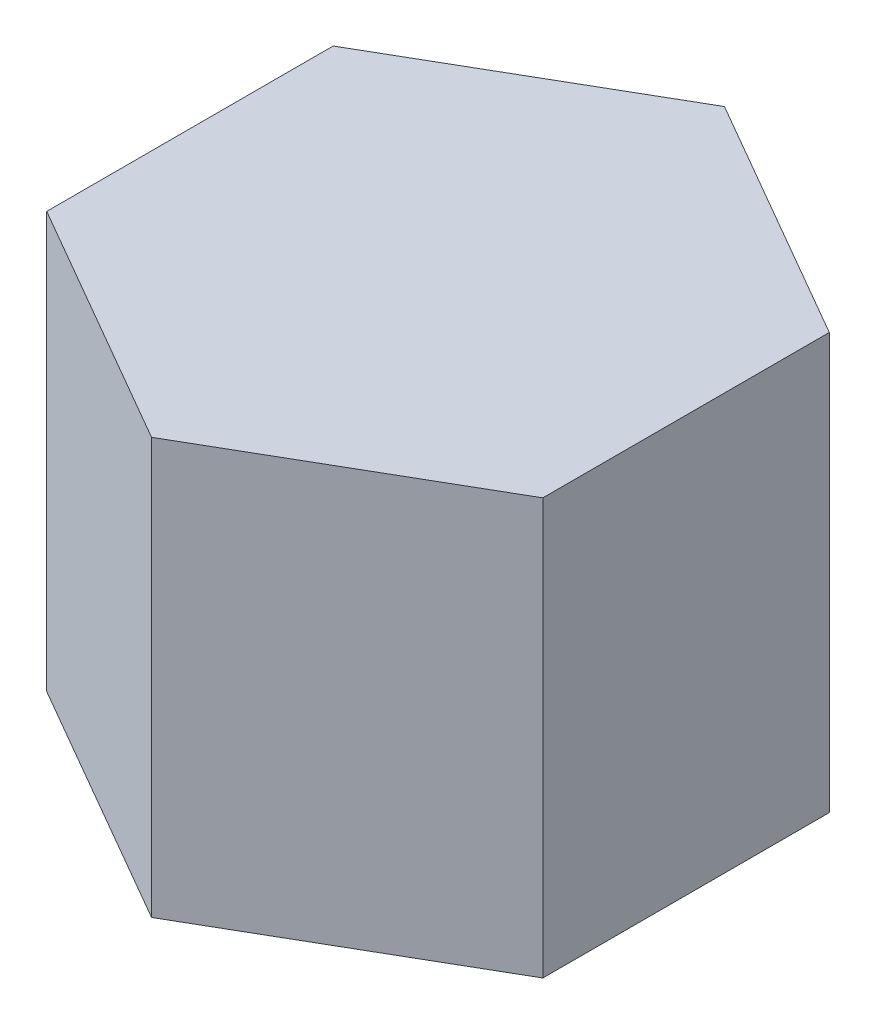
ISO-10303-21;
HEADER;
FILE_DESCRIPTION(('STEP AP214'),'2;1');
FILE_NAME('part.step','',(''),(''),'','','');
FILE_SCHEMA(('AUTOMOTIVE_DESIGN { 1 0 10303 214 1 1 1 1 }'));
ENDSEC;
DATA;
#1=APPLICATION_CONTEXT('core data for automotive mechanical design processes');
#2=APPLICATION_PROTOCOL_DEFINITION('international standard','automotive_design',2000,#1);
#3=PRODUCT_CONTEXT('',#1,'mechanical');
#4=PRODUCT('Part','Part','',(#3));
#5=PRODUCT_RELATED_PRODUCT_CATEGORY('part','',(#4));
#6=PRODUCT_DEFINITION_FORMATION('','',#4);
#7=PRODUCT_DEFINITION_CONTEXT('part definition',#1,'design');
#8=PRODUCT_DEFINITION('design','',#6,#7);
#9=PRODUCT_DEFINITION_SHAPE('','',#8);
#10=(LENGTH_UNIT() NAMED_UNIT(*) SI_UNIT(.MILLI.,.METRE.));
#11=(NAMED_UNIT(*) PLANE_ANGLE_UNIT() SI_UNIT($,.RADIAN.));
#12=(NAMED_UNIT(*) SI_UNIT($,.STERADIAN.) SOLID_ANGLE_UNIT());
#13=UNCERTAINTY_MEASURE_WITH_UNIT(LENGTH_MEASURE(1.E-05),#10,'distance_accuracy_value','');
#14=(GEOMETRIC_REPRESENTATION_CONTEXT(3) GLOBAL_UNCERTAINTY_ASSIGNED_CONTEXT((#13)) GLOBAL_UNIT_ASSIGNED_CONTEXT((#10,
#11,#12)) REPRESENTATION_CONTEXT('',''));
#15=CARTESIAN_POINT('',(0.,0.,0.));
#16=DIRECTION('',(0.,0.,1.));
#17=DIRECTION('',(1.,0.,0.));
#18=AXIS2_PLACEMENT_3D('',#15,#16,#17);
#19=CARTESIAN_POINT('',(205.642660308706,-148.537700895744,291.506971220494));
#20=DIRECTION('',(-0.499999999999909,0.,-0.866025403784491));
#21=DIRECTION('',(-0.866025403784491,0.,0.499999999999909));
#22=AXIS2_PLACEMENT_3D('',#19,#20,#21);
#23=PLANE('',#22);
#24=CARTESIAN_POINT('',(205.339551417382,-149.045793579175,291.681971220494));
#25=DIRECTION('',(0.866025403784491,0.,-0.499999999999909));
#26=VECTOR('',#25,1.);
#27=LINE('',#24,#26);
#28=CARTESIAN_POINT('',(205.339551417382,-149.045793579175,291.681971220494));
#29=VERTEX_POINT('',#28);
#30=CARTESIAN_POINT('',(205.642660308706,-149.045793579175,291.506971220494));
#31=VERTEX_POINT('',#30);
#32=EDGE_CURVE('E170',#29,#31,#27,.T.);
#33=ORIENTED_EDGE('',*,*,#32,.T.);
#34=CARTESIAN_POINT('',(205.642660308706,-148.537700895744,291.506971220494));
#35=DIRECTION('',(0.,-1.,0.));
#36=VECTOR('',#35,1.);
#37=LINE('',#34,#36);
#38=CARTESIAN_POINT('',(205.642660308706,-148.537700895744,291.506971220494));
#39=VERTEX_POINT('',#38);
#40=EDGE_CURVE('E35',#39,#31,#37,.T.);
#41=ORIENTED_EDGE('',*,*,#40,.F.);
#42=CARTESIAN_POINT('',(205.339551417382,-148.537700895744,291.681971220494));
#43=DIRECTION('',(0.866025403784491,0.,-0.499999999999909));
#44=VECTOR('',#43,1.);
#45=LINE('',#42,#44);
#46=CARTESIAN_POINT('',(205.339551417382,-148.537700895744,291.681971220494));
#47=VERTEX_POINT('',#46);
#48=EDGE_CURVE('E159',#47,#39,#45,.T.);
#49=ORIENTED_EDGE('',*,*,#48,.F.);
#50=CARTESIAN_POINT('',(205.339551417382,-148.537700895744,291.681971220494));
#51=DIRECTION('',(0.,-1.,0.));
#52=VECTOR('',#51,1.);
#53=LINE('',#50,#52);
#54=EDGE_CURVE('E10',#47,#29,#53,.T.);
#55=ORIENTED_EDGE('',*,*,#54,.T.);
#56=EDGE_LOOP('',(#33,#41,#49,#55));
#57=FACE_BOUND('',#56,.T.);
#58=ADVANCED_FACE('F16',(#57),#23,.F.);
#59=CARTESIAN_POINT('',(205.339551417382,-148.537700895744,291.681971220494));
#60=DIRECTION('',(0.500000000000062,0.,-0.866025403784403));
#61=DIRECTION('',(-0.866025403784403,0.,-0.500000000000062));
#62=AXIS2_PLACEMENT_3D('',#59,#60,#61);
#63=PLANE('',#62);
#64=CARTESIAN_POINT('',(205.036442526057,-149.045793579175,291.506971220494));
#65=DIRECTION('',(0.866025403784403,0.,0.500000000000062));
#66=VECTOR('',#65,1.);
#67=LINE('',#64,#66);
#68=CARTESIAN_POINT('',(205.036442526057,-149.045793579175,291.506971220494));
#69=VERTEX_POINT('',#68);
#70=EDGE_CURVE('E167',#69,#29,#67,.T.);
#71=ORIENTED_EDGE('',*,*,#70,.T.);
#72=ORIENTED_EDGE('',*,*,#54,.F.);
#73=CARTESIAN_POINT('',(205.036442526057,-148.537700895744,291.506971220494));
#74=DIRECTION('',(0.866025403784403,0.,0.500000000000062));
#75=VECTOR('',#74,1.);
#76=LINE('',#73,#75);
#77=CARTESIAN_POINT('',(205.036442526057,-148.537700895744,291.506971220494));
#78=VERTEX_POINT('',#77);
#79=EDGE_CURVE('E156',#78,#47,#76,.T.);
#80=ORIENTED_EDGE('',*,*,#79,.F.);
#81=CARTESIAN_POINT('',(205.036442526057,-148.537700895744,291.506971220494));
#82=DIRECTION('',(0.,-1.,0.));
#83=VECTOR('',#82,1.);
#84=LINE('',#81,#83);
#85=EDGE_CURVE('E27',#78,#69,#84,.T.);
#86=ORIENTED_EDGE('',*,*,#85,.T.);
#87=EDGE_LOOP('',(#71,#72,#80,#86));
#88=FACE_BOUND('',#87,.T.);
#89=ADVANCED_FACE('F189',(#88),#63,.F.);
#90=CARTESIAN_POINT('',(205.036442526057,-148.537700895744,290.831971220494));
#91=DIRECTION('',(1.,0.,0.));
#92=DIRECTION('',(0.,1.,0.));
#93=AXIS2_PLACEMENT_3D('',#90,#91,#92);
#94=PLANE('',#93);
#95=CARTESIAN_POINT('',(205.036442526057,-149.045793579175,291.156971220494));
#96=DIRECTION('',(0.,0.,1.));
#97=VECTOR('',#96,1.);
#98=LINE('',#95,#97);
#99=CARTESIAN_POINT('',(205.036442526057,-149.045793579175,291.156971220494));
#100=VERTEX_POINT('',#99);
#101=EDGE_CURVE('E163',#100,#69,#98,.T.);
#102=ORIENTED_EDGE('',*,*,#101,.T.);
#103=ORIENTED_EDGE('',*,*,#85,.F.);
#104=CARTESIAN_POINT('',(205.036442526057,-148.537700895744,291.156971220494));
#105=DIRECTION('',(0.,0.,1.));
#106=VECTOR('',#105,1.);
#107=LINE('',#104,#106);
#108=CARTESIAN_POINT('',(205.036442526057,-148.537700895744,291.156971220494));
#109=VERTEX_POINT('',#108);
#110=EDGE_CURVE('E106',#109,#78,#107,.T.);
#111=ORIENTED_EDGE('',*,*,#110,.F.);
#112=CARTESIAN_POINT('',(205.036442526057,-148.537700895744,291.156971220494));
#113=DIRECTION('',(0.,-1.,0.));
#114=VECTOR('',#113,1.);
#115=LINE('',#112,#114);
#116=EDGE_CURVE('E94',#109,#100,#115,.T.);
#117=ORIENTED_EDGE('',*,*,#116,.T.);
#118=EDGE_LOOP('',(#102,#103,#111,#117));
#119=FACE_BOUND('',#118,.T.);
#120=ADVANCED_FACE('F198',(#119),#94,.F.);
#121=CARTESIAN_POINT('',(205.036442526057,-148.537700895744,291.156971220494));
#122=DIRECTION('',(0.499999999999943,0.,0.866025403784472));
#123=DIRECTION('',(0.866025403784472,0.,-0.499999999999943));
#124=AXIS2_PLACEMENT_3D('',#121,#122,#123);
#125=PLANE('',#124);
#126=CARTESIAN_POINT('',(205.339551417382,-149.045793579175,290.981971220494));
#127=DIRECTION('',(-0.866025403784471,0.,0.499999999999943));
#128=VECTOR('',#127,1.);
#129=LINE('',#126,#128);
#130=CARTESIAN_POINT('',(205.339551417382,-149.045793579175,290.981971220494));
#131=VERTEX_POINT('',#130);
#132=EDGE_CURVE('E162',#131,#100,#129,.T.);
#133=ORIENTED_EDGE('',*,*,#132,.T.);
#134=ORIENTED_EDGE('',*,*,#116,.F.);
#135=CARTESIAN_POINT('',(205.339551417382,-148.537700895744,290.981971220494));
#136=DIRECTION('',(-0.866025403784471,0.,0.499999999999943));
#137=VECTOR('',#136,1.);
#138=LINE('',#135,#137);
#139=CARTESIAN_POINT('',(205.339551417382,-148.537700895744,290.981971220494));
#140=VERTEX_POINT('',#139);
#141=EDGE_CURVE('E98',#140,#109,#138,.T.);
#142=ORIENTED_EDGE('',*,*,#141,.F.);
#143=CARTESIAN_POINT('',(205.339551417382,-148.537700895744,290.981971220494));
#144=DIRECTION('',(0.,-1.,0.));
#145=VECTOR('',#144,1.);
#146=LINE('',#143,#145);
#147=EDGE_CURVE('E79',#140,#131,#146,.T.);
#148=ORIENTED_EDGE('',*,*,#147,.T.);
#149=EDGE_LOOP('',(#133,#134,#142,#148));
#150=FACE_BOUND('',#149,.T.);
#151=ADVANCED_FACE('F100',(#150),#125,.F.);
#152=CARTESIAN_POINT('',(205.339551417382,-148.537700895744,290.981971220494));
#153=DIRECTION('',(-0.500000000000096,0.,0.866025403784383));
#154=DIRECTION('',(0.866025403784383,0.,0.500000000000096));
#155=AXIS2_PLACEMENT_3D('',#152,#153,#154);
#156=PLANE('',#155);
#157=CARTESIAN_POINT('',(205.642660308706,-149.045793579175,291.156971220494));
#158=DIRECTION('',(-0.866025403784383,0.,-0.500000000000096));
#159=VECTOR('',#158,1.);
#160=LINE('',#157,#159);
#161=CARTESIAN_POINT('',(205.642660308706,-149.045793579175,291.156971220494));
#162=VERTEX_POINT('',#161);
#163=EDGE_CURVE('E88',#162,#131,#160,.T.);
#164=ORIENTED_EDGE('',*,*,#163,.T.);
#165=ORIENTED_EDGE('',*,*,#147,.F.);
#166=CARTESIAN_POINT('',(205.642660308706,-148.537700895744,291.156971220494));
#167=DIRECTION('',(-0.866025403784383,0.,-0.500000000000096));
#168=VECTOR('',#167,1.);
#169=LINE('',#166,#168);
#170=CARTESIAN_POINT('',(205.642660308706,-148.537700895744,291.156971220494));
#171=VERTEX_POINT('',#170);
#172=EDGE_CURVE('E84',#171,#140,#169,.T.);
#173=ORIENTED_EDGE('',*,*,#172,.F.);
#174=CARTESIAN_POINT('',(205.642660308706,-148.537700895744,291.156971220494));
#175=DIRECTION('',(0.,-1.,0.));
#176=VECTOR('',#175,1.);
#177=LINE('',#174,#176);
#178=EDGE_CURVE('E58',#171,#162,#177,.T.);
#179=ORIENTED_EDGE('',*,*,#178,.T.);
#180=EDGE_LOOP('',(#164,#165,#173,#179));
#181=FACE_BOUND('',#180,.T.);
#182=ADVANCED_FACE('F82',(#181),#156,.F.);
#183=CARTESIAN_POINT('',(205.642660308706,-148.537700895744,290.831971220494));
#184=DIRECTION('',(-1.,0.,0.));
#185=DIRECTION('',(0.,-1.,0.));
#186=AXIS2_PLACEMENT_3D('',#183,#184,#185);
#187=PLANE('',#186);
#188=CARTESIAN_POINT('',(205.642660308706,-149.045793579175,291.506971220494));
#189=DIRECTION('',(0.,0.,-1.));
#190=VECTOR('',#189,1.);
#191=LINE('',#188,#190);
#192=EDGE_CURVE('E160',#31,#162,#191,.T.);
#193=ORIENTED_EDGE('',*,*,#192,.T.);
#194=ORIENTED_EDGE('',*,*,#178,.F.);
#195=CARTESIAN_POINT('',(205.642660308706,-148.537700895744,291.506971220494));
#196=DIRECTION('',(0.,0.,-1.));
#197=VECTOR('',#196,1.);
#198=LINE('',#195,#197);
#199=EDGE_CURVE('E112',#39,#171,#198,.T.);
#200=ORIENTED_EDGE('',*,*,#199,.F.);
#201=ORIENTED_EDGE('',*,*,#40,.T.);
#202=EDGE_LOOP('',(#193,#194,#200,#201));
#203=FACE_BOUND('',#202,.T.);
#204=ADVANCED_FACE('F131',(#203),#187,.F.);
#205=CARTESIAN_POINT('',(206.339551417382,-148.537700895744,290.831971220494));
#206=DIRECTION('',(0.,-1.,0.));
#207=DIRECTION('',(1.,0.,0.));
#208=AXIS2_PLACEMENT_3D('',#205,#206,#207);
#209=PLANE('',#208);
#210=ORIENTED_EDGE('',*,*,#48,.T.);
#211=ORIENTED_EDGE('',*,*,#199,.T.);
#212=ORIENTED_EDGE('',*,*,#172,.T.);
#213=ORIENTED_EDGE('',*,*,#141,.T.);
#214=ORIENTED_EDGE('',*,*,#110,.T.);
#215=ORIENTED_EDGE('',*,*,#79,.T.);
#216=EDGE_LOOP('',(#210,#211,#212,#213,#214,#215));
#217=FACE_BOUND('',#216,.T.);
#218=ADVANCED_FACE('F111',(#217),#209,.F.);
#219=CARTESIAN_POINT('',(206.339551417382,-149.045793579175,290.831971220494));
#220=DIRECTION('',(0.,-1.,0.));
#221=DIRECTION('',(1.,0.,0.));
#222=AXIS2_PLACEMENT_3D('',#219,#220,#221);
#223=PLANE('',#222);
#224=ORIENTED_EDGE('',*,*,#32,.F.);
#225=ORIENTED_EDGE('',*,*,#70,.F.);
#226=ORIENTED_EDGE('',*,*,#101,.F.);
#227=ORIENTED_EDGE('',*,*,#132,.F.);
#228=ORIENTED_EDGE('',*,*,#163,.F.);
#229=ORIENTED_EDGE('',*,*,#192,.F.);
#230=EDGE_LOOP('',(#224,#225,#226,#227,#228,#229));
#231=FACE_BOUND('',#230,.T.);
#232=ADVANCED_FACE('F130',(#231),#223,.T.);
#233=CLOSED_SHELL('',(#58,#89,#120,#151,#182,#204,#218,#232));
#234=MANIFOLD_SOLID_BREP('B1',#233);
#235=ADVANCED_BREP_SHAPE_REPRESENTATION('',(#18,#234),#14);
#236=SHAPE_DEFINITION_REPRESENTATION(#9,#235);
ENDSEC;
END-ISO-10303-21;
